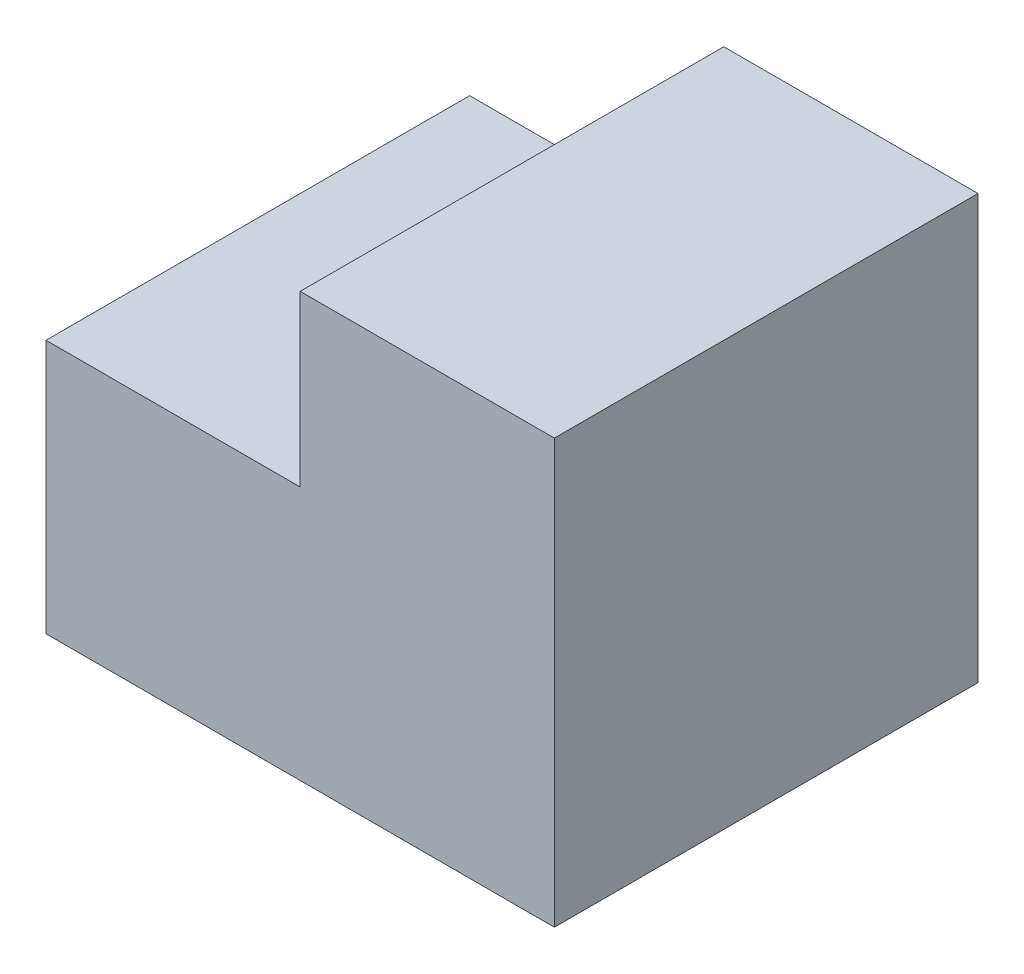
ISO-10303-21;
HEADER;
FILE_DESCRIPTION(('STEP AP214'),'2;1');
FILE_NAME('part.step','',(''),(''),'','','');
FILE_SCHEMA(('AUTOMOTIVE_DESIGN { 1 0 10303 214 1 1 1 1 }'));
ENDSEC;
DATA;
#1=APPLICATION_CONTEXT('core data for automotive mechanical design processes');
#2=APPLICATION_PROTOCOL_DEFINITION('international standard','automotive_design',2000,#1);
#3=PRODUCT_CONTEXT('',#1,'mechanical');
#4=PRODUCT('Part','Part','',(#3));
#5=PRODUCT_RELATED_PRODUCT_CATEGORY('part','',(#4));
#6=PRODUCT_DEFINITION_FORMATION('','',#4);
#7=PRODUCT_DEFINITION_CONTEXT('part definition',#1,'design');
#8=PRODUCT_DEFINITION('design','',#6,#7);
#9=PRODUCT_DEFINITION_SHAPE('','',#8);
#10=(LENGTH_UNIT() NAMED_UNIT(*) SI_UNIT(.MILLI.,.METRE.));
#11=(NAMED_UNIT(*) PLANE_ANGLE_UNIT() SI_UNIT($,.RADIAN.));
#12=(NAMED_UNIT(*) SI_UNIT($,.STERADIAN.) SOLID_ANGLE_UNIT());
#13=UNCERTAINTY_MEASURE_WITH_UNIT(LENGTH_MEASURE(1.E-05),#10,'distance_accuracy_value','');
#14=(GEOMETRIC_REPRESENTATION_CONTEXT(3) GLOBAL_UNCERTAINTY_ASSIGNED_CONTEXT((#13)) GLOBAL_UNIT_ASSIGNED_CONTEXT((#10,
#11,#12)) REPRESENTATION_CONTEXT('',''));
#15=CARTESIAN_POINT('',(0.,0.,0.));
#16=DIRECTION('',(0.,0.,1.));
#17=DIRECTION('',(1.,0.,0.));
#18=AXIS2_PLACEMENT_3D('',#15,#16,#17);
#19=CARTESIAN_POINT('',(-30.,15.,25.));
#20=DIRECTION('',(1.,0.,0.));
#21=DIRECTION('',(0.,1.,0.));
#22=AXIS2_PLACEMENT_3D('',#19,#20,#21);
#23=PLANE('',#22);
#24=DIRECTION('',(0.,-1.,0.));
#25=VECTOR('',#24,1.);
#26=CARTESIAN_POINT('',(-30.,15.,0.));
#27=LINE('',#26,#25);
#28=CARTESIAN_POINT('',(-30.,15.,0.));
#29=VERTEX_POINT('',#28);
#30=CARTESIAN_POINT('',(-30.,0.,0.));
#31=VERTEX_POINT('',#30);
#32=EDGE_CURVE('E117',#29,#31,#27,.T.);
#33=ORIENTED_EDGE('',*,*,#32,.T.);
#34=DIRECTION('',(0.,0.,-1.));
#35=VECTOR('',#34,1.);
#36=CARTESIAN_POINT('',(-30.,0.,25.));
#37=LINE('',#36,#35);
#38=CARTESIAN_POINT('',(-30.,0.,25.));
#39=VERTEX_POINT('',#38);
#40=EDGE_CURVE('E11',#39,#31,#37,.T.);
#41=ORIENTED_EDGE('',*,*,#40,.F.);
#42=DIRECTION('',(0.,-1.,0.));
#43=VECTOR('',#42,1.);
#44=CARTESIAN_POINT('',(-30.,15.,25.));
#45=LINE('',#44,#43);
#46=CARTESIAN_POINT('',(-30.,15.,25.));
#47=VERTEX_POINT('',#46);
#48=EDGE_CURVE('E127',#47,#39,#45,.T.);
#49=ORIENTED_EDGE('',*,*,#48,.F.);
#50=DIRECTION('',(0.,0.,-1.));
#51=VECTOR('',#50,1.);
#52=CARTESIAN_POINT('',(-30.,15.,25.));
#53=LINE('',#52,#51);
#54=EDGE_CURVE('E113',#47,#29,#53,.T.);
#55=ORIENTED_EDGE('',*,*,#54,.T.);
#56=EDGE_LOOP('',(#33,#41,#49,#55));
#57=FACE_BOUND('',#56,.T.);
#58=ADVANCED_FACE('F33',(#57),#23,.F.);
#59=CARTESIAN_POINT('',(-30.,0.,25.));
#60=DIRECTION('',(0.,1.,0.));
#61=DIRECTION('',(0.,0.,1.));
#62=AXIS2_PLACEMENT_3D('',#59,#60,#61);
#63=PLANE('',#62);
#64=DIRECTION('',(1.,0.,0.));
#65=VECTOR('',#64,1.);
#66=CARTESIAN_POINT('',(-30.,0.,0.));
#67=LINE('',#66,#65);
#68=CARTESIAN_POINT('',(0.,0.,0.));
#69=VERTEX_POINT('',#68);
#70=EDGE_CURVE('E120',#31,#69,#67,.T.);
#71=ORIENTED_EDGE('',*,*,#70,.T.);
#72=DIRECTION('',(0.,0.,-1.));
#73=VECTOR('',#72,1.);
#74=CARTESIAN_POINT('',(0.,0.,25.));
#75=LINE('',#74,#73);
#76=CARTESIAN_POINT('',(0.,0.,25.));
#77=VERTEX_POINT('',#76);
#78=EDGE_CURVE('E41',#77,#69,#75,.T.);
#79=ORIENTED_EDGE('',*,*,#78,.F.);
#80=DIRECTION('',(1.,0.,0.));
#81=VECTOR('',#80,1.);
#82=CARTESIAN_POINT('',(-30.,0.,25.));
#83=LINE('',#82,#81);
#84=EDGE_CURVE('E86',#39,#77,#83,.T.);
#85=ORIENTED_EDGE('',*,*,#84,.F.);
#86=ORIENTED_EDGE('',*,*,#40,.T.);
#87=EDGE_LOOP('',(#71,#79,#85,#86));
#88=FACE_BOUND('',#87,.T.);
#89=ADVANCED_FACE('F151',(#88),#63,.F.);
#90=CARTESIAN_POINT('',(0.,0.,25.));
#91=DIRECTION('',(-1.,0.,0.));
#92=DIRECTION('',(0.,0.,1.));
#93=AXIS2_PLACEMENT_3D('',#90,#91,#92);
#94=PLANE('',#93);
#95=DIRECTION('',(0.,1.,0.));
#96=VECTOR('',#95,1.);
#97=CARTESIAN_POINT('',(0.,0.,0.));
#98=LINE('',#97,#96);
#99=CARTESIAN_POINT('',(0.,25.,0.));
#100=VERTEX_POINT('',#99);
#101=EDGE_CURVE('E122',#69,#100,#98,.T.);
#102=ORIENTED_EDGE('',*,*,#101,.T.);
#103=DIRECTION('',(0.,0.,-1.));
#104=VECTOR('',#103,1.);
#105=CARTESIAN_POINT('',(0.,25.,25.));
#106=LINE('',#105,#104);
#107=CARTESIAN_POINT('',(0.,25.,25.));
#108=VERTEX_POINT('',#107);
#109=EDGE_CURVE('E108',#108,#100,#106,.T.);
#110=ORIENTED_EDGE('',*,*,#109,.F.);
#111=DIRECTION('',(0.,1.,0.));
#112=VECTOR('',#111,1.);
#113=CARTESIAN_POINT('',(0.,0.,25.));
#114=LINE('',#113,#112);
#115=EDGE_CURVE('E99',#77,#108,#114,.T.);
#116=ORIENTED_EDGE('',*,*,#115,.F.);
#117=ORIENTED_EDGE('',*,*,#78,.T.);
#118=EDGE_LOOP('',(#102,#110,#116,#117));
#119=FACE_BOUND('',#118,.T.);
#120=ADVANCED_FACE('F133',(#119),#94,.F.);
#121=CARTESIAN_POINT('',(0.,25.,25.));
#122=DIRECTION('',(0.,-1.,0.));
#123=DIRECTION('',(0.,0.,-1.));
#124=AXIS2_PLACEMENT_3D('',#121,#122,#123);
#125=PLANE('',#124);
#126=DIRECTION('',(-1.,0.,0.));
#127=VECTOR('',#126,1.);
#128=CARTESIAN_POINT('',(0.,25.,0.));
#129=LINE('',#128,#127);
#130=CARTESIAN_POINT('',(-15.,25.,0.));
#131=VERTEX_POINT('',#130);
#132=EDGE_CURVE('E107',#100,#131,#129,.T.);
#133=ORIENTED_EDGE('',*,*,#132,.T.);
#134=DIRECTION('',(0.,0.,-1.));
#135=VECTOR('',#134,1.);
#136=CARTESIAN_POINT('',(-15.,25.,25.));
#137=LINE('',#136,#135);
#138=CARTESIAN_POINT('',(-15.,25.,25.));
#139=VERTEX_POINT('',#138);
#140=EDGE_CURVE('E104',#139,#131,#137,.T.);
#141=ORIENTED_EDGE('',*,*,#140,.F.);
#142=DIRECTION('',(-1.,0.,0.));
#143=VECTOR('',#142,1.);
#144=CARTESIAN_POINT('',(0.,25.,25.));
#145=LINE('',#144,#143);
#146=EDGE_CURVE('E93',#108,#139,#145,.T.);
#147=ORIENTED_EDGE('',*,*,#146,.F.);
#148=ORIENTED_EDGE('',*,*,#109,.T.);
#149=EDGE_LOOP('',(#133,#141,#147,#148));
#150=FACE_BOUND('',#149,.T.);
#151=ADVANCED_FACE('F105',(#150),#125,.F.);
#152=CARTESIAN_POINT('',(-15.,25.,25.));
#153=DIRECTION('',(1.,0.,0.));
#154=DIRECTION('',(0.,1.,0.));
#155=AXIS2_PLACEMENT_3D('',#152,#153,#154);
#156=PLANE('',#155);
#157=DIRECTION('',(0.,-1.,0.));
#158=VECTOR('',#157,1.);
#159=CARTESIAN_POINT('',(-15.,25.,0.));
#160=LINE('',#159,#158);
#161=CARTESIAN_POINT('',(-15.,15.,0.));
#162=VERTEX_POINT('',#161);
#163=EDGE_CURVE('E72',#131,#162,#160,.T.);
#164=ORIENTED_EDGE('',*,*,#163,.T.);
#165=DIRECTION('',(0.,0.,-1.));
#166=VECTOR('',#165,1.);
#167=CARTESIAN_POINT('',(-15.,15.,25.));
#168=LINE('',#167,#166);
#169=CARTESIAN_POINT('',(-15.,15.,25.));
#170=VERTEX_POINT('',#169);
#171=EDGE_CURVE('E109',#170,#162,#168,.T.);
#172=ORIENTED_EDGE('',*,*,#171,.F.);
#173=DIRECTION('',(0.,-1.,0.));
#174=VECTOR('',#173,1.);
#175=CARTESIAN_POINT('',(-15.,25.,25.));
#176=LINE('',#175,#174);
#177=EDGE_CURVE('E97',#139,#170,#176,.T.);
#178=ORIENTED_EDGE('',*,*,#177,.F.);
#179=ORIENTED_EDGE('',*,*,#140,.T.);
#180=EDGE_LOOP('',(#164,#172,#178,#179));
#181=FACE_BOUND('',#180,.T.);
#182=ADVANCED_FACE('F111',(#181),#156,.F.);
#183=CARTESIAN_POINT('',(-15.,15.,25.));
#184=DIRECTION('',(0.,-1.,0.));
#185=DIRECTION('',(1.,0.,0.));
#186=AXIS2_PLACEMENT_3D('',#183,#184,#185);
#187=PLANE('',#186);
#188=DIRECTION('',(-1.,0.,0.));
#189=VECTOR('',#188,1.);
#190=CARTESIAN_POINT('',(-15.,15.,0.));
#191=LINE('',#190,#189);
#192=EDGE_CURVE('E78',#162,#29,#191,.T.);
#193=ORIENTED_EDGE('',*,*,#192,.T.);
#194=ORIENTED_EDGE('',*,*,#54,.F.);
#195=DIRECTION('',(-1.,0.,0.));
#196=VECTOR('',#195,1.);
#197=CARTESIAN_POINT('',(-15.,15.,25.));
#198=LINE('',#197,#196);
#199=EDGE_CURVE('E49',#170,#47,#198,.T.);
#200=ORIENTED_EDGE('',*,*,#199,.F.);
#201=ORIENTED_EDGE('',*,*,#171,.T.);
#202=EDGE_LOOP('',(#193,#194,#200,#201));
#203=FACE_BOUND('',#202,.T.);
#204=ADVANCED_FACE('F140',(#203),#187,.F.);
#205=CARTESIAN_POINT('',(0.,0.,25.));
#206=DIRECTION('',(0.,0.,1.));
#207=DIRECTION('',(1.,0.,0.));
#208=AXIS2_PLACEMENT_3D('',#205,#206,#207);
#209=PLANE('',#208);
#210=ORIENTED_EDGE('',*,*,#48,.T.);
#211=ORIENTED_EDGE('',*,*,#84,.T.);
#212=ORIENTED_EDGE('',*,*,#115,.T.);
#213=ORIENTED_EDGE('',*,*,#146,.T.);
#214=ORIENTED_EDGE('',*,*,#177,.T.);
#215=ORIENTED_EDGE('',*,*,#199,.T.);
#216=EDGE_LOOP('',(#210,#211,#212,#213,#214,#215));
#217=FACE_BOUND('',#216,.T.);
#218=ADVANCED_FACE('F95',(#217),#209,.T.);
#219=CARTESIAN_POINT('',(0.,0.,0.));
#220=DIRECTION('',(0.,0.,1.));
#221=DIRECTION('',(1.,0.,0.));
#222=AXIS2_PLACEMENT_3D('',#219,#220,#221);
#223=PLANE('',#222);
#224=ORIENTED_EDGE('',*,*,#32,.F.);
#225=ORIENTED_EDGE('',*,*,#192,.F.);
#226=ORIENTED_EDGE('',*,*,#163,.F.);
#227=ORIENTED_EDGE('',*,*,#132,.F.);
#228=ORIENTED_EDGE('',*,*,#101,.F.);
#229=ORIENTED_EDGE('',*,*,#70,.F.);
#230=EDGE_LOOP('',(#224,#225,#226,#227,#228,#229));
#231=FACE_BOUND('',#230,.T.);
#232=ADVANCED_FACE('F136',(#231),#223,.F.);
#233=CLOSED_SHELL('',(#58,#89,#120,#151,#182,#204,#218,#232));
#234=MANIFOLD_SOLID_BREP('B2',#233);
#235=ADVANCED_BREP_SHAPE_REPRESENTATION('',(#18,#234),#14);
#236=SHAPE_DEFINITION_REPRESENTATION(#9,#235);
ENDSEC;
END-ISO-10303-21;
